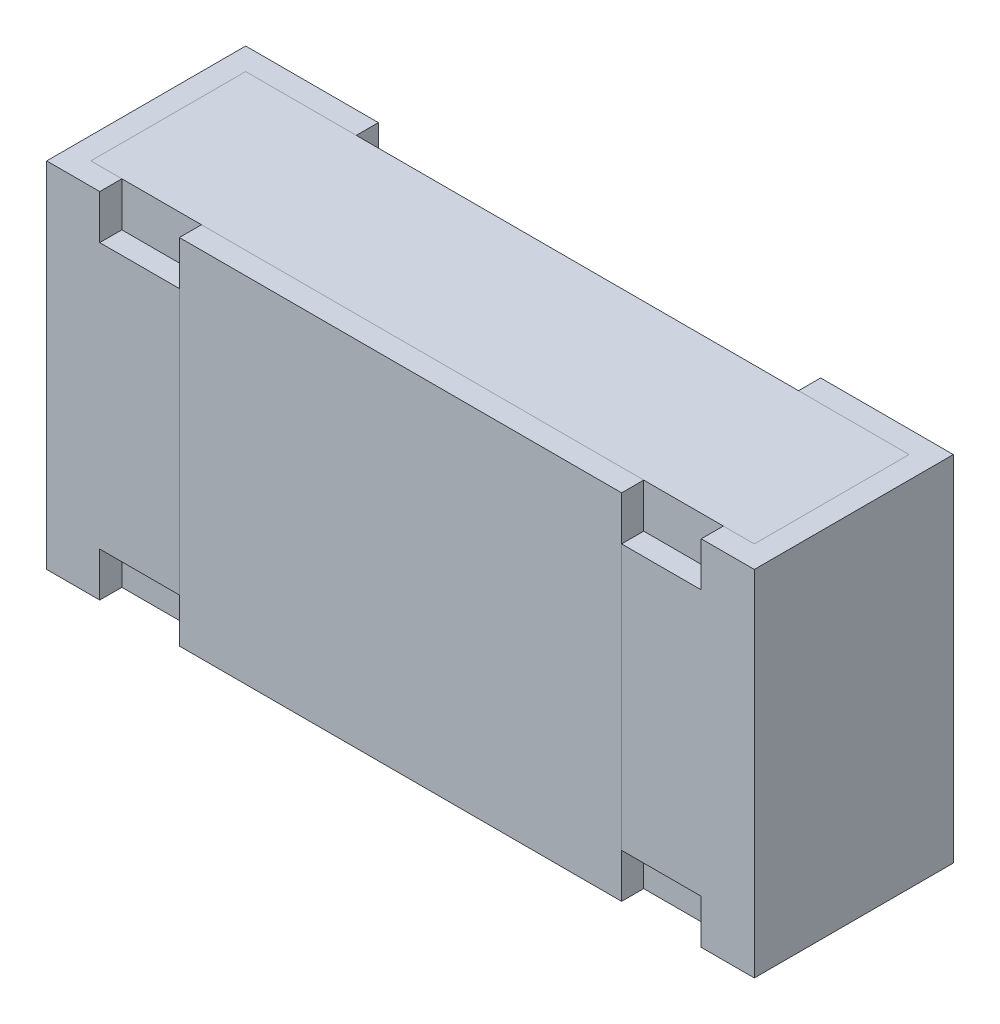
ISO-10303-21;
HEADER;
FILE_DESCRIPTION(('STEP AP214'),'2;1');
FILE_NAME('part.step','',(''),(''),'','','');
FILE_SCHEMA(('AUTOMOTIVE_DESIGN { 1 0 10303 214 1 1 1 1 }'));
ENDSEC;
DATA;
#1=APPLICATION_CONTEXT('core data for automotive mechanical design processes');
#2=APPLICATION_PROTOCOL_DEFINITION('international standard','automotive_design',2000,#1);
#3=PRODUCT_CONTEXT('',#1,'mechanical');
#4=PRODUCT('Part','Part','',(#3));
#5=PRODUCT_RELATED_PRODUCT_CATEGORY('part','',(#4));
#6=PRODUCT_DEFINITION_FORMATION('','',#4);
#7=PRODUCT_DEFINITION_CONTEXT('part definition',#1,'design');
#8=PRODUCT_DEFINITION('design','',#6,#7);
#9=PRODUCT_DEFINITION_SHAPE('','',#8);
#10=(LENGTH_UNIT() NAMED_UNIT(*) SI_UNIT(.MILLI.,.METRE.));
#11=(NAMED_UNIT(*) PLANE_ANGLE_UNIT() SI_UNIT($,.RADIAN.));
#12=(NAMED_UNIT(*) SI_UNIT($,.STERADIAN.) SOLID_ANGLE_UNIT());
#13=UNCERTAINTY_MEASURE_WITH_UNIT(LENGTH_MEASURE(1.E-05),#10,'distance_accuracy_value','');
#14=(GEOMETRIC_REPRESENTATION_CONTEXT(3) GLOBAL_UNCERTAINTY_ASSIGNED_CONTEXT((#13)) GLOBAL_UNIT_ASSIGNED_CONTEXT((#10,
#11,#12)) REPRESENTATION_CONTEXT('',''));
#15=CARTESIAN_POINT('',(0.,0.,0.));
#16=DIRECTION('',(0.,0.,1.));
#17=DIRECTION('',(1.,0.,0.));
#18=AXIS2_PLACEMENT_3D('',#15,#16,#17);
#19=CARTESIAN_POINT('',(-0.74991872,0.40008128,0.4));
#20=DIRECTION('',(1.,0.,0.));
#21=DIRECTION('',(0.,1.,0.));
#22=AXIS2_PLACEMENT_3D('',#19,#20,#21);
#23=PLANE('',#22);
#24=DIRECTION('',(0.,0.,-1.));
#25=VECTOR('',#24,1.);
#26=CARTESIAN_POINT('',(-0.74991872,0.40008128,0.4));
#27=LINE('',#26,#25);
#28=CARTESIAN_POINT('',(-0.74991872,0.40008128,0.4));
#29=VERTEX_POINT('',#28);
#30=CARTESIAN_POINT('',(-0.74991872,0.40008128,0.05));
#31=VERTEX_POINT('',#30);
#32=EDGE_CURVE('P0_E10',#29,#31,#27,.T.);
#33=ORIENTED_EDGE('',*,*,#32,.T.);
#34=DIRECTION('',(0.,-1.,0.));
#35=VECTOR('',#34,1.);
#36=CARTESIAN_POINT('',(-0.74991872,0.40008128,0.05));
#37=LINE('',#36,#35);
#38=CARTESIAN_POINT('',(-0.74991872,-0.39991872,0.05));
#39=VERTEX_POINT('',#38);
#40=EDGE_CURVE('P0_E23',#31,#39,#37,.T.);
#41=ORIENTED_EDGE('',*,*,#40,.T.);
#42=DIRECTION('',(0.,0.,-1.));
#43=VECTOR('',#42,1.);
#44=CARTESIAN_POINT('',(-0.74991872,-0.39991872,0.4));
#45=LINE('',#44,#43);
#46=CARTESIAN_POINT('',(-0.74991872,-0.39991872,0.4));
#47=VERTEX_POINT('',#46);
#48=EDGE_CURVE('P0_E85',#47,#39,#45,.T.);
#49=ORIENTED_EDGE('',*,*,#48,.F.);
#50=DIRECTION('',(0.,-1.,0.));
#51=VECTOR('',#50,1.);
#52=CARTESIAN_POINT('',(-0.74991872,0.40008128,0.4));
#53=LINE('',#52,#51);
#54=EDGE_CURVE('P0_E83',#29,#47,#53,.T.);
#55=ORIENTED_EDGE('',*,*,#54,.F.);
#56=EDGE_LOOP('',(#33,#41,#49,#55));
#57=FACE_BOUND('',#56,.T.);
#58=ADVANCED_FACE('P0_F16',(#57),#23,.F.);
#59=CARTESIAN_POINT('',(0.75008128,-0.39991872,0.4));
#60=DIRECTION('',(0.,1.,0.));
#61=DIRECTION('',(-1.,0.,0.));
#62=AXIS2_PLACEMENT_3D('',#59,#60,#61);
#63=PLANE('',#62);
#64=ORIENTED_EDGE('',*,*,#48,.T.);
#65=DIRECTION('',(-1.,0.,0.));
#66=VECTOR('',#65,1.);
#67=CARTESIAN_POINT('',(-0.74991872,-0.39991872,0.05));
#68=LINE('',#67,#66);
#69=CARTESIAN_POINT('',(0.75008128,-0.39991872,0.05));
#70=VERTEX_POINT('',#69);
#71=EDGE_CURVE('P0_E80',#70,#39,#68,.T.);
#72=ORIENTED_EDGE('',*,*,#71,.F.);
#73=DIRECTION('',(0.,0.,-1.));
#74=VECTOR('',#73,1.);
#75=CARTESIAN_POINT('',(0.75008128,-0.39991872,0.4));
#76=LINE('',#75,#74);
#77=CARTESIAN_POINT('',(0.75008128,-0.39991872,0.4));
#78=VERTEX_POINT('',#77);
#79=EDGE_CURVE('P0_E78',#78,#70,#76,.T.);
#80=ORIENTED_EDGE('',*,*,#79,.F.);
#81=DIRECTION('',(1.,0.,0.));
#82=VECTOR('',#81,1.);
#83=CARTESIAN_POINT('',(0.75008128,-0.39991872,0.4));
#84=LINE('',#83,#82);
#85=EDGE_CURVE('P0_E69',#47,#78,#84,.T.);
#86=ORIENTED_EDGE('',*,*,#85,.F.);
#87=EDGE_LOOP('',(#64,#72,#80,#86));
#88=FACE_BOUND('',#87,.T.);
#89=ADVANCED_FACE('P0_F89',(#88),#63,.F.);
#90=CARTESIAN_POINT('',(0.75008128,0.40008128,0.4));
#91=DIRECTION('',(-1.,0.,0.));
#92=DIRECTION('',(0.,-1.,0.));
#93=AXIS2_PLACEMENT_3D('',#90,#91,#92);
#94=PLANE('',#93);
#95=ORIENTED_EDGE('',*,*,#79,.T.);
#96=DIRECTION('',(0.,-1.,0.));
#97=VECTOR('',#96,1.);
#98=CARTESIAN_POINT('',(0.75008128,0.40008128,0.05));
#99=LINE('',#98,#97);
#100=CARTESIAN_POINT('',(0.75008128,0.40008128,0.05));
#101=VERTEX_POINT('',#100);
#102=EDGE_CURVE('P0_E59',#101,#70,#99,.T.);
#103=ORIENTED_EDGE('',*,*,#102,.F.);
#104=DIRECTION('',(0.,0.,-1.));
#105=VECTOR('',#104,1.);
#106=CARTESIAN_POINT('',(0.75008128,0.40008128,0.4));
#107=LINE('',#106,#105);
#108=CARTESIAN_POINT('',(0.75008128,0.40008128,0.4));
#109=VERTEX_POINT('',#108);
#110=EDGE_CURVE('P0_E53',#109,#101,#107,.T.);
#111=ORIENTED_EDGE('',*,*,#110,.F.);
#112=DIRECTION('',(0.,1.,0.));
#113=VECTOR('',#112,1.);
#114=CARTESIAN_POINT('',(0.75008128,0.40008128,0.4));
#115=LINE('',#114,#113);
#116=EDGE_CURVE('P0_E57',#78,#109,#115,.T.);
#117=ORIENTED_EDGE('',*,*,#116,.F.);
#118=EDGE_LOOP('',(#95,#103,#111,#117));
#119=FACE_BOUND('',#118,.T.);
#120=ADVANCED_FACE('P0_F56',(#119),#94,.F.);
#121=CARTESIAN_POINT('',(0.75008128,0.40008128,0.4));
#122=DIRECTION('',(0.,-1.,0.));
#123=DIRECTION('',(1.,0.,0.));
#124=AXIS2_PLACEMENT_3D('',#121,#122,#123);
#125=PLANE('',#124);
#126=ORIENTED_EDGE('',*,*,#110,.T.);
#127=DIRECTION('',(-1.,0.,0.));
#128=VECTOR('',#127,1.);
#129=CARTESIAN_POINT('',(-0.74991872,0.40008128,0.05));
#130=LINE('',#129,#128);
#131=EDGE_CURVE('P0_E70',#101,#31,#130,.T.);
#132=ORIENTED_EDGE('',*,*,#131,.T.);
#133=ORIENTED_EDGE('',*,*,#32,.F.);
#134=DIRECTION('',(-1.,0.,0.));
#135=VECTOR('',#134,1.);
#136=CARTESIAN_POINT('',(0.75008128,0.40008128,0.4));
#137=LINE('',#136,#135);
#138=EDGE_CURVE('P0_E67',#109,#29,#137,.T.);
#139=ORIENTED_EDGE('',*,*,#138,.F.);
#140=EDGE_LOOP('',(#126,#132,#133,#139));
#141=FACE_BOUND('',#140,.T.);
#142=ADVANCED_FACE('P0_F72',(#141),#125,.F.);
#143=CARTESIAN_POINT('',(-0.74991872,-0.39991872,0.4));
#144=DIRECTION('',(0.,0.,-1.));
#145=DIRECTION('',(0.,1.,0.));
#146=AXIS2_PLACEMENT_3D('',#143,#144,#145);
#147=PLANE('',#146);
#148=ORIENTED_EDGE('',*,*,#85,.T.);
#149=ORIENTED_EDGE('',*,*,#116,.T.);
#150=ORIENTED_EDGE('',*,*,#138,.T.);
#151=ORIENTED_EDGE('',*,*,#54,.T.);
#152=EDGE_LOOP('',(#148,#149,#150,#151));
#153=FACE_BOUND('',#152,.T.);
#154=ADVANCED_FACE('P0_F65',(#153),#147,.F.);
#155=CARTESIAN_POINT('',(-0.74991872,0.40008128,0.05));
#156=DIRECTION('',(0.,0.,1.));
#157=DIRECTION('',(0.,-1.,0.));
#158=AXIS2_PLACEMENT_3D('',#155,#156,#157);
#159=PLANE('',#158);
#160=ORIENTED_EDGE('',*,*,#71,.T.);
#161=ORIENTED_EDGE('',*,*,#40,.F.);
#162=ORIENTED_EDGE('',*,*,#131,.F.);
#163=ORIENTED_EDGE('',*,*,#102,.T.);
#164=EDGE_LOOP('',(#160,#161,#162,#163));
#165=FACE_BOUND('',#164,.T.);
#166=ADVANCED_FACE('P0_F90',(#165),#159,.F.);
#167=CLOSED_SHELL('',(#58,#89,#120,#142,#154,#166));
#168=MANIFOLD_SOLID_BREP('P0_B1',#167);
#169=CARTESIAN_POINT('',(1.30164225709407,-0.399918720000001,0.450000000000004));
#170=DIRECTION('',(0.,1.,0.));
#171=DIRECTION('',(-1.,0.,0.));
#172=AXIS2_PLACEMENT_3D('',#169,#170,#171);
#173=PLANE('',#172);
#174=DIRECTION('',(0.,0.,-1.));
#175=VECTOR('',#174,1.);
#176=CARTESIAN_POINT('',(0.50008128,-0.39991872,0.450000000000006));
#177=LINE('',#176,#175);
#178=CARTESIAN_POINT('',(0.50008128,-0.39991872,0.450000000000002));
#179=VERTEX_POINT('',#178);
#180=CARTESIAN_POINT('',(0.50008128,-0.39991872,0.400000000000002));
#181=VERTEX_POINT('',#180);
#182=EDGE_CURVE('P1_E11',#179,#181,#177,.T.);
#183=ORIENTED_EDGE('',*,*,#182,.F.);
#184=DIRECTION('',(-1.,0.,0.));
#185=VECTOR('',#184,1.);
#186=CARTESIAN_POINT('',(1.30164225709407,-0.399918720000001,0.450000000000004));
#187=LINE('',#186,#185);
#188=CARTESIAN_POINT('',(-0.49991872,-0.39991872,0.45));
#189=VERTEX_POINT('',#188);
#190=EDGE_CURVE('P1_E24',#179,#189,#187,.T.);
#191=ORIENTED_EDGE('',*,*,#190,.T.);
#192=DIRECTION('',(0.,0.,-1.));
#193=VECTOR('',#192,1.);
#194=CARTESIAN_POINT('',(-0.49991872,-0.39991872,0.45));
#195=LINE('',#194,#193);
#196=CARTESIAN_POINT('',(-0.49991872,-0.39991872,0.4));
#197=VERTEX_POINT('',#196);
#198=EDGE_CURVE('P1_E75',#189,#197,#195,.T.);
#199=ORIENTED_EDGE('',*,*,#198,.T.);
#200=DIRECTION('',(-1.,0.,0.));
#201=VECTOR('',#200,1.);
#202=CARTESIAN_POINT('',(1.30164225709407,-0.399918720000001,0.400000000000004));
#203=LINE('',#202,#201);
#204=EDGE_CURVE('P1_E85',#181,#197,#203,.T.);
#205=ORIENTED_EDGE('',*,*,#204,.F.);
#206=EDGE_LOOP('',(#183,#191,#199,#205));
#207=FACE_BOUND('',#206,.T.);
#208=ADVANCED_FACE('P1_F17',(#207),#173,.F.);
#209=CARTESIAN_POINT('',(1.30164225709407,-0.399918720000001,0.400000000000004));
#210=DIRECTION('',(0.,0.,1.));
#211=DIRECTION('',(-1.,0.,0.));
#212=AXIS2_PLACEMENT_3D('',#209,#210,#211);
#213=PLANE('',#212);
#214=DIRECTION('',(0.,1.,0.));
#215=VECTOR('',#214,1.);
#216=CARTESIAN_POINT('',(0.50008128,-0.399918720000001,0.400000000000002));
#217=LINE('',#216,#215);
#218=CARTESIAN_POINT('',(0.50008128,0.40008128,0.400000000000002));
#219=VERTEX_POINT('',#218);
#220=EDGE_CURVE('P1_E83',#181,#219,#217,.T.);
#221=ORIENTED_EDGE('',*,*,#220,.F.);
#222=ORIENTED_EDGE('',*,*,#204,.T.);
#223=DIRECTION('',(0.,1.,0.));
#224=VECTOR('',#223,1.);
#225=CARTESIAN_POINT('',(-0.49991872,-0.39991872,0.4));
#226=LINE('',#225,#224);
#227=CARTESIAN_POINT('',(-0.49991872,0.40008128,0.4));
#228=VERTEX_POINT('',#227);
#229=EDGE_CURVE('P1_E81',#197,#228,#226,.T.);
#230=ORIENTED_EDGE('',*,*,#229,.T.);
#231=DIRECTION('',(-1.,0.,0.));
#232=VECTOR('',#231,1.);
#233=CARTESIAN_POINT('',(1.30164225709407,0.40008128,0.400000000000004));
#234=LINE('',#233,#232);
#235=EDGE_CURVE('P1_E61',#219,#228,#234,.T.);
#236=ORIENTED_EDGE('',*,*,#235,.F.);
#237=EDGE_LOOP('',(#221,#222,#230,#236));
#238=FACE_BOUND('',#237,.T.);
#239=ADVANCED_FACE('P1_F91',(#238),#213,.F.);
#240=CARTESIAN_POINT('',(1.30164225709407,0.40008128,0.450000000000004));
#241=DIRECTION('',(0.,-1.,0.));
#242=DIRECTION('',(1.,0.,0.));
#243=AXIS2_PLACEMENT_3D('',#240,#241,#242);
#244=PLANE('',#243);
#245=DIRECTION('',(0.,0.,1.));
#246=VECTOR('',#245,1.);
#247=CARTESIAN_POINT('',(0.50008128,0.40008128,0.450000000000006));
#248=LINE('',#247,#246);
#249=CARTESIAN_POINT('',(0.50008128,0.40008128,0.450000000000002));
#250=VERTEX_POINT('',#249);
#251=EDGE_CURVE('P1_E65',#219,#250,#248,.T.);
#252=ORIENTED_EDGE('',*,*,#251,.F.);
#253=ORIENTED_EDGE('',*,*,#235,.T.);
#254=DIRECTION('',(0.,0.,1.));
#255=VECTOR('',#254,1.);
#256=CARTESIAN_POINT('',(-0.49991872,0.40008128,0.45));
#257=LINE('',#256,#255);
#258=CARTESIAN_POINT('',(-0.49991872,0.40008128,0.45));
#259=VERTEX_POINT('',#258);
#260=EDGE_CURVE('P1_E54',#228,#259,#257,.T.);
#261=ORIENTED_EDGE('',*,*,#260,.T.);
#262=DIRECTION('',(-1.,0.,0.));
#263=VECTOR('',#262,1.);
#264=CARTESIAN_POINT('',(1.30164225709407,0.40008128,0.450000000000004));
#265=LINE('',#264,#263);
#266=EDGE_CURVE('P1_E58',#250,#259,#265,.T.);
#267=ORIENTED_EDGE('',*,*,#266,.F.);
#268=EDGE_LOOP('',(#252,#253,#261,#267));
#269=FACE_BOUND('',#268,.T.);
#270=ADVANCED_FACE('P1_F57',(#269),#244,.F.);
#271=CARTESIAN_POINT('',(1.30164225709407,-0.399918720000001,0.450000000000004));
#272=DIRECTION('',(0.,0.,-1.));
#273=DIRECTION('',(1.,0.,0.));
#274=AXIS2_PLACEMENT_3D('',#271,#272,#273);
#275=PLANE('',#274);
#276=DIRECTION('',(0.,-1.,0.));
#277=VECTOR('',#276,1.);
#278=CARTESIAN_POINT('',(0.50008128,-0.399918720000001,0.450000000000002));
#279=LINE('',#278,#277);
#280=EDGE_CURVE('P1_E71',#250,#179,#279,.T.);
#281=ORIENTED_EDGE('',*,*,#280,.F.);
#282=ORIENTED_EDGE('',*,*,#266,.T.);
#283=DIRECTION('',(0.,-1.,0.));
#284=VECTOR('',#283,1.);
#285=CARTESIAN_POINT('',(-0.49991872,-0.39991872,0.45));
#286=LINE('',#285,#284);
#287=EDGE_CURVE('P1_E70',#259,#189,#286,.T.);
#288=ORIENTED_EDGE('',*,*,#287,.T.);
#289=ORIENTED_EDGE('',*,*,#190,.F.);
#290=EDGE_LOOP('',(#281,#282,#288,#289));
#291=FACE_BOUND('',#290,.T.);
#292=ADVANCED_FACE('P1_F69',(#291),#275,.F.);
#293=CARTESIAN_POINT('',(-0.49991872,-0.39991872,0.4));
#294=DIRECTION('',(1.,0.,0.));
#295=DIRECTION('',(0.,0.,1.));
#296=AXIS2_PLACEMENT_3D('',#293,#294,#295);
#297=PLANE('',#296);
#298=ORIENTED_EDGE('',*,*,#260,.F.);
#299=ORIENTED_EDGE('',*,*,#229,.F.);
#300=ORIENTED_EDGE('',*,*,#198,.F.);
#301=ORIENTED_EDGE('',*,*,#287,.F.);
#302=EDGE_LOOP('',(#298,#299,#300,#301));
#303=FACE_BOUND('',#302,.T.);
#304=ADVANCED_FACE('P1_F74',(#303),#297,.F.);
#305=CARTESIAN_POINT('',(0.50008128,-0.39991872,0.45));
#306=DIRECTION('',(1.,0.,0.));
#307=DIRECTION('',(0.,0.,-1.));
#308=AXIS2_PLACEMENT_3D('',#305,#306,#307);
#309=PLANE('',#308);
#310=ORIENTED_EDGE('',*,*,#280,.T.);
#311=ORIENTED_EDGE('',*,*,#182,.T.);
#312=ORIENTED_EDGE('',*,*,#220,.T.);
#313=ORIENTED_EDGE('',*,*,#251,.T.);
#314=EDGE_LOOP('',(#310,#311,#312,#313));
#315=FACE_BOUND('',#314,.T.);
#316=ADVANCED_FACE('P1_F88',(#315),#309,.T.);
#317=CLOSED_SHELL('',(#208,#239,#270,#292,#304,#316));
#318=MANIFOLD_SOLID_BREP('P1_B1',#317);
#319=CARTESIAN_POINT('',(-0.74991872,0.40008128,0.0499999999999998));
#320=DIRECTION('',(0.,0.,-1.));
#321=DIRECTION('',(0.,1.,0.));
#322=AXIS2_PLACEMENT_3D('',#319,#320,#321);
#323=PLANE('',#322);
#324=DIRECTION('',(0.,-1.,0.));
#325=VECTOR('',#324,1.);
#326=CARTESIAN_POINT('',(-0.49991872,0.40008128,0.0499999999999999));
#327=LINE('',#326,#325);
#328=CARTESIAN_POINT('',(-0.49991872,0.40008128,0.0500000000000003));
#329=VERTEX_POINT('',#328);
#330=CARTESIAN_POINT('',(-0.49991872,-0.39991872,0.05));
#331=VERTEX_POINT('',#330);
#332=EDGE_CURVE('P2_E11',#329,#331,#327,.T.);
#333=ORIENTED_EDGE('',*,*,#332,.F.);
#334=DIRECTION('',(1.,0.,0.));
#335=VECTOR('',#334,1.);
#336=CARTESIAN_POINT('',(-0.74991872,0.40008128,0.0500000000000002));
#337=LINE('',#336,#335);
#338=CARTESIAN_POINT('',(-0.74991872,0.40008128,0.0500000000000002));
#339=VERTEX_POINT('',#338);
#340=EDGE_CURVE('P2_E24',#339,#329,#337,.T.);
#341=ORIENTED_EDGE('',*,*,#340,.F.);
#342=DIRECTION('',(0.,1.,0.));
#343=VECTOR('',#342,1.);
#344=CARTESIAN_POINT('',(-0.74991872,0.40008128,0.0499999999999998));
#345=LINE('',#344,#343);
#346=CARTESIAN_POINT('',(-0.74991872,-0.39991872,0.0500000000000003));
#347=VERTEX_POINT('',#346);
#348=EDGE_CURVE('P2_E203',#347,#339,#345,.T.);
#349=ORIENTED_EDGE('',*,*,#348,.F.);
#350=DIRECTION('',(1.,0.,0.));
#351=VECTOR('',#350,1.);
#352=CARTESIAN_POINT('',(-0.74991872,-0.39991872,0.0500000000000003));
#353=LINE('',#352,#351);
#354=EDGE_CURVE('P2_E201',#347,#331,#353,.T.);
#355=ORIENTED_EDGE('',*,*,#354,.T.);
#356=EDGE_LOOP('',(#333,#341,#349,#355));
#357=FACE_BOUND('',#356,.T.);
#358=ADVANCED_FACE('P2_F17',(#357),#323,.F.);
#359=CARTESIAN_POINT('',(-0.79991872,-0.39991872,0.));
#360=DIRECTION('',(0.,0.,1.));
#361=DIRECTION('',(-1.,0.,0.));
#362=AXIS2_PLACEMENT_3D('',#359,#360,#361);
#363=PLANE('',#362);
#364=DIRECTION('',(0.,1.,0.));
#365=VECTOR('',#364,1.);
#366=CARTESIAN_POINT('',(-0.49991872,-0.39991872,0.));
#367=LINE('',#366,#365);
#368=CARTESIAN_POINT('',(-0.49991872,-0.39991872,0.));
#369=VERTEX_POINT('',#368);
#370=CARTESIAN_POINT('',(-0.49991872,0.40008128,0.));
#371=VERTEX_POINT('',#370);
#372=EDGE_CURVE('P2_E199',#369,#371,#367,.T.);
#373=ORIENTED_EDGE('',*,*,#372,.F.);
#374=DIRECTION('',(1.,0.,0.));
#375=VECTOR('',#374,1.);
#376=CARTESIAN_POINT('',(-0.79991872,-0.39991872,0.));
#377=LINE('',#376,#375);
#378=CARTESIAN_POINT('',(-0.79991872,-0.39991872,0.));
#379=VERTEX_POINT('',#378);
#380=EDGE_CURVE('P2_E196',#379,#369,#377,.T.);
#381=ORIENTED_EDGE('',*,*,#380,.F.);
#382=DIRECTION('',(0.,-1.,0.));
#383=VECTOR('',#382,1.);
#384=CARTESIAN_POINT('',(-0.79991872,-0.39991872,0.));
#385=LINE('',#384,#383);
#386=CARTESIAN_POINT('',(-0.79991872,0.40008128,0.));
#387=VERTEX_POINT('',#386);
#388=EDGE_CURVE('P2_E193',#387,#379,#385,.T.);
#389=ORIENTED_EDGE('',*,*,#388,.F.);
#390=DIRECTION('',(1.,0.,0.));
#391=VECTOR('',#390,1.);
#392=CARTESIAN_POINT('',(-0.79991872,0.40008128,0.));
#393=LINE('',#392,#391);
#394=EDGE_CURVE('P2_E190',#387,#371,#393,.T.);
#395=ORIENTED_EDGE('',*,*,#394,.T.);
#396=EDGE_LOOP('',(#373,#381,#389,#395));
#397=FACE_BOUND('',#396,.T.);
#398=ADVANCED_FACE('P2_F213',(#397),#363,.F.);
#399=CARTESIAN_POINT('',(-0.74991872,0.400081280000001,0.4));
#400=DIRECTION('',(1.,0.,0.));
#401=DIRECTION('',(0.,0.,1.));
#402=AXIS2_PLACEMENT_3D('',#399,#400,#401);
#403=PLANE('',#402);
#404=DIRECTION('',(0.,0.,-1.));
#405=VECTOR('',#404,1.);
#406=CARTESIAN_POINT('',(-0.74991872,-0.39991872,0.4));
#407=LINE('',#406,#405);
#408=CARTESIAN_POINT('',(-0.74991872,-0.39991872,0.4));
#409=VERTEX_POINT('',#408);
#410=EDGE_CURVE('P2_E187',#409,#347,#407,.T.);
#411=ORIENTED_EDGE('',*,*,#410,.T.);
#412=ORIENTED_EDGE('',*,*,#348,.T.);
#413=DIRECTION('',(0.,0.,-1.));
#414=VECTOR('',#413,1.);
#415=CARTESIAN_POINT('',(-0.74991872,0.40008128,0.4));
#416=LINE('',#415,#414);
#417=CARTESIAN_POINT('',(-0.74991872,0.40008128,0.4));
#418=VERTEX_POINT('',#417);
#419=EDGE_CURVE('P2_E184',#418,#339,#416,.T.);
#420=ORIENTED_EDGE('',*,*,#419,.F.);
#421=DIRECTION('',(0.,-1.,0.));
#422=VECTOR('',#421,1.);
#423=CARTESIAN_POINT('',(-0.74991872,0.400081280000001,0.4));
#424=LINE('',#423,#422);
#425=EDGE_CURVE('P2_E181',#418,#409,#424,.T.);
#426=ORIENTED_EDGE('',*,*,#425,.T.);
#427=EDGE_LOOP('',(#411,#412,#420,#426));
#428=FACE_BOUND('',#427,.T.);
#429=ADVANCED_FACE('P2_F223',(#428),#403,.T.);
#430=CARTESIAN_POINT('',(-0.79991872,-0.39991872,0.45));
#431=DIRECTION('',(-1.,0.,0.));
#432=DIRECTION('',(0.,0.,-1.));
#433=AXIS2_PLACEMENT_3D('',#430,#431,#432);
#434=PLANE('',#433);
#435=DIRECTION('',(0.,0.,-1.));
#436=VECTOR('',#435,1.);
#437=CARTESIAN_POINT('',(-0.79991872,0.40008128,0.45));
#438=LINE('',#437,#436);
#439=CARTESIAN_POINT('',(-0.79991872,0.40008128,0.45));
#440=VERTEX_POINT('',#439);
#441=EDGE_CURVE('P2_E178',#440,#387,#438,.T.);
#442=ORIENTED_EDGE('',*,*,#441,.T.);
#443=ORIENTED_EDGE('',*,*,#388,.T.);
#444=DIRECTION('',(0.,0.,-1.));
#445=VECTOR('',#444,1.);
#446=CARTESIAN_POINT('',(-0.79991872,-0.39991872,0.45));
#447=LINE('',#446,#445);
#448=CARTESIAN_POINT('',(-0.79991872,-0.39991872,0.45));
#449=VERTEX_POINT('',#448);
#450=EDGE_CURVE('P2_E175',#449,#379,#447,.T.);
#451=ORIENTED_EDGE('',*,*,#450,.F.);
#452=DIRECTION('',(0.,1.,0.));
#453=VECTOR('',#452,1.);
#454=CARTESIAN_POINT('',(-0.79991872,-0.39991872,0.45));
#455=LINE('',#454,#453);
#456=EDGE_CURVE('P2_E172',#449,#440,#455,.T.);
#457=ORIENTED_EDGE('',*,*,#456,.T.);
#458=EDGE_LOOP('',(#442,#443,#451,#457));
#459=FACE_BOUND('',#458,.T.);
#460=ADVANCED_FACE('P2_F215',(#459),#434,.T.);
#461=CARTESIAN_POINT('',(-1.57647969709407,0.400081280000001,0.4));
#462=DIRECTION('',(0.,0.,1.));
#463=DIRECTION('',(0.,-1.,0.));
#464=AXIS2_PLACEMENT_3D('',#461,#462,#463);
#465=PLANE('',#464);
#466=DIRECTION('',(0.,-1.,0.));
#467=VECTOR('',#466,1.);
#468=CARTESIAN_POINT('',(-0.49991872,0.40008128,0.4));
#469=LINE('',#468,#467);
#470=CARTESIAN_POINT('',(-0.49991872,0.300081280000001,0.4));
#471=VERTEX_POINT('',#470);
#472=CARTESIAN_POINT('',(-0.49991872,-0.29991872,0.4));
#473=VERTEX_POINT('',#472);
#474=EDGE_CURVE('P2_E170',#471,#473,#469,.T.);
#475=ORIENTED_EDGE('',*,*,#474,.T.);
#476=DIRECTION('',(1.,0.,0.));
#477=VECTOR('',#476,1.);
#478=CARTESIAN_POINT('',(-0.49991872,-0.29991872,0.4));
#479=LINE('',#478,#477);
#480=CARTESIAN_POINT('',(-0.67991872,-0.29991872,0.4));
#481=VERTEX_POINT('',#480);
#482=EDGE_CURVE('P2_E167',#481,#473,#479,.T.);
#483=ORIENTED_EDGE('',*,*,#482,.F.);
#484=DIRECTION('',(0.,1.,0.));
#485=VECTOR('',#484,1.);
#486=CARTESIAN_POINT('',(-0.67991872,-0.39991872,0.4));
#487=LINE('',#486,#485);
#488=CARTESIAN_POINT('',(-0.67991872,-0.39991872,0.4));
#489=VERTEX_POINT('',#488);
#490=EDGE_CURVE('P2_E164',#489,#481,#487,.T.);
#491=ORIENTED_EDGE('',*,*,#490,.F.);
#492=DIRECTION('',(1.,0.,0.));
#493=VECTOR('',#492,1.);
#494=CARTESIAN_POINT('',(-1.57647969709407,-0.39991872,0.4));
#495=LINE('',#494,#493);
#496=EDGE_CURVE('P2_E161',#409,#489,#495,.T.);
#497=ORIENTED_EDGE('',*,*,#496,.F.);
#498=ORIENTED_EDGE('',*,*,#425,.F.);
#499=DIRECTION('',(1.,0.,0.));
#500=VECTOR('',#499,1.);
#501=CARTESIAN_POINT('',(-1.57647969709407,0.400081280000001,0.4));
#502=LINE('',#501,#500);
#503=CARTESIAN_POINT('',(-0.67991872,0.40008128,0.4));
#504=VERTEX_POINT('',#503);
#505=EDGE_CURVE('P2_E159',#418,#504,#502,.T.);
#506=ORIENTED_EDGE('',*,*,#505,.T.);
#507=DIRECTION('',(0.,1.,0.));
#508=VECTOR('',#507,1.);
#509=CARTESIAN_POINT('',(-0.67991872,0.40008128,0.4));
#510=LINE('',#509,#508);
#511=CARTESIAN_POINT('',(-0.67991872,0.300081280000001,0.4));
#512=VERTEX_POINT('',#511);
#513=EDGE_CURVE('P2_E157',#512,#504,#510,.T.);
#514=ORIENTED_EDGE('',*,*,#513,.F.);
#515=DIRECTION('',(-1.,0.,0.));
#516=VECTOR('',#515,1.);
#517=CARTESIAN_POINT('',(-0.49991872,0.300081280000001,0.4));
#518=LINE('',#517,#516);
#519=EDGE_CURVE('P2_E127',#471,#512,#518,.T.);
#520=ORIENTED_EDGE('',*,*,#519,.F.);
#521=EDGE_LOOP('',(#475,#483,#491,#497,#498,#506,#514,#520));
#522=FACE_BOUND('',#521,.T.);
#523=ADVANCED_FACE('P2_F219',(#522),#465,.F.);
#524=CARTESIAN_POINT('',(-1.57647969709407,0.400081280000001,0.45));
#525=DIRECTION('',(0.,-1.,0.));
#526=DIRECTION('',(1.,0.,0.));
#527=AXIS2_PLACEMENT_3D('',#524,#525,#526);
#528=PLANE('',#527);
#529=DIRECTION('',(1.,0.,0.));
#530=VECTOR('',#529,1.);
#531=CARTESIAN_POINT('',(-1.57647969709407,0.400081280000001,0.45));
#532=LINE('',#531,#530);
#533=CARTESIAN_POINT('',(-0.67991872,0.400081280000001,0.45));
#534=VERTEX_POINT('',#533);
#535=EDGE_CURVE('P2_E154',#440,#534,#532,.T.);
#536=ORIENTED_EDGE('',*,*,#535,.T.);
#537=DIRECTION('',(0.,0.,1.));
#538=VECTOR('',#537,1.);
#539=CARTESIAN_POINT('',(-0.67991872,0.400081280000001,-0.00100000000000021));
#540=LINE('',#539,#538);
#541=EDGE_CURVE('P2_E122',#504,#534,#540,.T.);
#542=ORIENTED_EDGE('',*,*,#541,.F.);
#543=ORIENTED_EDGE('',*,*,#505,.F.);
#544=ORIENTED_EDGE('',*,*,#419,.T.);
#545=ORIENTED_EDGE('',*,*,#340,.T.);
#546=DIRECTION('',(0.,0.,1.));
#547=VECTOR('',#546,1.);
#548=CARTESIAN_POINT('',(-0.49991872,0.40008128,0.225));
#549=LINE('',#548,#547);
#550=EDGE_CURVE('P2_E151',#371,#329,#549,.T.);
#551=ORIENTED_EDGE('',*,*,#550,.F.);
#552=ORIENTED_EDGE('',*,*,#394,.F.);
#553=ORIENTED_EDGE('',*,*,#441,.F.);
#554=EDGE_LOOP('',(#536,#542,#543,#544,#545,#551,#552,#553));
#555=FACE_BOUND('',#554,.T.);
#556=ADVANCED_FACE('P2_F207',(#555),#528,.F.);
#557=CARTESIAN_POINT('',(-1.57647969709407,-0.39991872,0.45));
#558=DIRECTION('',(0.,0.,-1.));
#559=DIRECTION('',(0.,1.,0.));
#560=AXIS2_PLACEMENT_3D('',#557,#558,#559);
#561=PLANE('',#560);
#562=DIRECTION('',(0.,-1.,0.));
#563=VECTOR('',#562,1.);
#564=CARTESIAN_POINT('',(-0.67991872,-0.39991872,0.45));
#565=LINE('',#564,#563);
#566=CARTESIAN_POINT('',(-0.67991872,-0.29991872,0.45));
#567=VERTEX_POINT('',#566);
#568=CARTESIAN_POINT('',(-0.67991872,-0.39991872,0.45));
#569=VERTEX_POINT('',#568);
#570=EDGE_CURVE('P2_E148',#567,#569,#565,.T.);
#571=ORIENTED_EDGE('',*,*,#570,.F.);
#572=DIRECTION('',(-1.,0.,0.));
#573=VECTOR('',#572,1.);
#574=CARTESIAN_POINT('',(-0.49991872,-0.29991872,0.45));
#575=LINE('',#574,#573);
#576=CARTESIAN_POINT('',(-0.49991872,-0.29991872,0.45));
#577=VERTEX_POINT('',#576);
#578=EDGE_CURVE('P2_E145',#577,#567,#575,.T.);
#579=ORIENTED_EDGE('',*,*,#578,.F.);
#580=DIRECTION('',(0.,1.,0.));
#581=VECTOR('',#580,1.);
#582=CARTESIAN_POINT('',(-0.49991872,-0.39991872,0.45));
#583=LINE('',#582,#581);
#584=CARTESIAN_POINT('',(-0.49991872,0.300081280000001,0.45));
#585=VERTEX_POINT('',#584);
#586=EDGE_CURVE('P2_E109',#577,#585,#583,.T.);
#587=ORIENTED_EDGE('',*,*,#586,.T.);
#588=DIRECTION('',(1.,0.,0.));
#589=VECTOR('',#588,1.);
#590=CARTESIAN_POINT('',(-0.49991872,0.300081280000001,0.45));
#591=LINE('',#590,#589);
#592=CARTESIAN_POINT('',(-0.67991872,0.300081280000001,0.45));
#593=VERTEX_POINT('',#592);
#594=EDGE_CURVE('P2_E102',#593,#585,#591,.T.);
#595=ORIENTED_EDGE('',*,*,#594,.F.);
#596=DIRECTION('',(0.,-1.,0.));
#597=VECTOR('',#596,1.);
#598=CARTESIAN_POINT('',(-0.67991872,0.400081280000001,0.45));
#599=LINE('',#598,#597);
#600=EDGE_CURVE('P2_E106',#534,#593,#599,.T.);
#601=ORIENTED_EDGE('',*,*,#600,.F.);
#602=ORIENTED_EDGE('',*,*,#535,.F.);
#603=ORIENTED_EDGE('',*,*,#456,.F.);
#604=DIRECTION('',(1.,0.,0.));
#605=VECTOR('',#604,1.);
#606=CARTESIAN_POINT('',(-1.57647969709407,-0.39991872,0.45));
#607=LINE('',#606,#605);
#608=EDGE_CURVE('P2_E123',#449,#569,#607,.T.);
#609=ORIENTED_EDGE('',*,*,#608,.T.);
#610=EDGE_LOOP('',(#571,#579,#587,#595,#601,#602,#603,#609));
#611=FACE_BOUND('',#610,.T.);
#612=ADVANCED_FACE('P2_F104',(#611),#561,.F.);
#613=CARTESIAN_POINT('',(-1.57647969709407,-0.39991872,0.4));
#614=DIRECTION('',(0.,1.,0.));
#615=DIRECTION('',(0.,0.,1.));
#616=AXIS2_PLACEMENT_3D('',#613,#614,#615);
#617=PLANE('',#616);
#618=ORIENTED_EDGE('',*,*,#496,.T.);
#619=DIRECTION('',(0.,0.,1.));
#620=VECTOR('',#619,1.);
#621=CARTESIAN_POINT('',(-0.67991872,-0.39991872,-0.00100000000000016));
#622=LINE('',#621,#620);
#623=EDGE_CURVE('P2_E140',#489,#569,#622,.T.);
#624=ORIENTED_EDGE('',*,*,#623,.T.);
#625=ORIENTED_EDGE('',*,*,#608,.F.);
#626=ORIENTED_EDGE('',*,*,#450,.T.);
#627=ORIENTED_EDGE('',*,*,#380,.T.);
#628=DIRECTION('',(0.,0.,-1.));
#629=VECTOR('',#628,1.);
#630=CARTESIAN_POINT('',(-0.49991872,-0.39991872,0.225));
#631=LINE('',#630,#629);
#632=EDGE_CURVE('P2_E138',#331,#369,#631,.T.);
#633=ORIENTED_EDGE('',*,*,#632,.F.);
#634=ORIENTED_EDGE('',*,*,#354,.F.);
#635=ORIENTED_EDGE('',*,*,#410,.F.);
#636=EDGE_LOOP('',(#618,#624,#625,#626,#627,#633,#634,#635));
#637=FACE_BOUND('',#636,.T.);
#638=ADVANCED_FACE('P2_F226',(#637),#617,.F.);
#639=CARTESIAN_POINT('',(-0.49991872,-0.39991872,0.45));
#640=DIRECTION('',(-1.,0.,0.));
#641=DIRECTION('',(0.,0.,-1.));
#642=AXIS2_PLACEMENT_3D('',#639,#640,#641);
#643=PLANE('',#642);
#644=ORIENTED_EDGE('',*,*,#586,.F.);
#645=DIRECTION('',(0.,0.,1.));
#646=VECTOR('',#645,1.);
#647=CARTESIAN_POINT('',(-0.49991872,-0.29991872,-0.00100000000000017));
#648=LINE('',#647,#646);
#649=EDGE_CURVE('P2_E131',#473,#577,#648,.T.);
#650=ORIENTED_EDGE('',*,*,#649,.F.);
#651=ORIENTED_EDGE('',*,*,#474,.F.);
#652=DIRECTION('',(0.,0.,1.));
#653=VECTOR('',#652,1.);
#654=CARTESIAN_POINT('',(-0.49991872,0.30008128,-0.0010000000000002));
#655=LINE('',#654,#653);
#656=EDGE_CURVE('P2_E128',#471,#585,#655,.T.);
#657=ORIENTED_EDGE('',*,*,#656,.T.);
#658=EDGE_LOOP('',(#644,#650,#651,#657));
#659=FACE_BOUND('',#658,.T.);
#660=ADVANCED_FACE('P2_F235',(#659),#643,.F.);
#661=CARTESIAN_POINT('',(-0.49991872,8.12800000002324E-05,0.0250000000000001));
#662=DIRECTION('',(1.,0.,0.));
#663=DIRECTION('',(0.,0.,1.));
#664=AXIS2_PLACEMENT_3D('',#661,#662,#663);
#665=PLANE('',#664);
#666=ORIENTED_EDGE('',*,*,#632,.T.);
#667=ORIENTED_EDGE('',*,*,#372,.T.);
#668=ORIENTED_EDGE('',*,*,#550,.T.);
#669=ORIENTED_EDGE('',*,*,#332,.T.);
#670=EDGE_LOOP('',(#666,#667,#668,#669));
#671=FACE_BOUND('',#670,.T.);
#672=ADVANCED_FACE('P2_F210',(#671),#665,.T.);
#673=CARTESIAN_POINT('',(-0.67991872,0.400081280000001,-0.00100000000000021));
#674=DIRECTION('',(-1.,0.,0.));
#675=DIRECTION('',(0.,-1.,0.));
#676=AXIS2_PLACEMENT_3D('',#673,#674,#675);
#677=PLANE('',#676);
#678=ORIENTED_EDGE('',*,*,#513,.T.);
#679=ORIENTED_EDGE('',*,*,#541,.T.);
#680=ORIENTED_EDGE('',*,*,#600,.T.);
#681=DIRECTION('',(0.,0.,1.));
#682=VECTOR('',#681,1.);
#683=CARTESIAN_POINT('',(-0.67991872,0.300081280000001,-0.0010000000000002));
#684=LINE('',#683,#682);
#685=EDGE_CURVE('P2_E119',#512,#593,#684,.T.);
#686=ORIENTED_EDGE('',*,*,#685,.F.);
#687=EDGE_LOOP('',(#678,#679,#680,#686));
#688=FACE_BOUND('',#687,.T.);
#689=ADVANCED_FACE('P2_F118',(#688),#677,.F.);
#690=CARTESIAN_POINT('',(-0.49991872,0.30008128,-0.0010000000000002));
#691=DIRECTION('',(0.,-1.,0.));
#692=DIRECTION('',(1.,0.,0.));
#693=AXIS2_PLACEMENT_3D('',#690,#691,#692);
#694=PLANE('',#693);
#695=ORIENTED_EDGE('',*,*,#519,.T.);
#696=ORIENTED_EDGE('',*,*,#685,.T.);
#697=ORIENTED_EDGE('',*,*,#594,.T.);
#698=ORIENTED_EDGE('',*,*,#656,.F.);
#699=EDGE_LOOP('',(#695,#696,#697,#698));
#700=FACE_BOUND('',#699,.T.);
#701=ADVANCED_FACE('P2_F125',(#700),#694,.F.);
#702=CARTESIAN_POINT('',(-0.49991872,-0.29991872,-0.00100000000000017));
#703=DIRECTION('',(0.,1.,0.));
#704=DIRECTION('',(-1.,0.,0.));
#705=AXIS2_PLACEMENT_3D('',#702,#703,#704);
#706=PLANE('',#705);
#707=ORIENTED_EDGE('',*,*,#482,.T.);
#708=ORIENTED_EDGE('',*,*,#649,.T.);
#709=ORIENTED_EDGE('',*,*,#578,.T.);
#710=DIRECTION('',(0.,0.,1.));
#711=VECTOR('',#710,1.);
#712=CARTESIAN_POINT('',(-0.67991872,-0.29991872,-0.00100000000000017));
#713=LINE('',#712,#711);
#714=EDGE_CURVE('P2_E129',#481,#567,#713,.T.);
#715=ORIENTED_EDGE('',*,*,#714,.F.);
#716=EDGE_LOOP('',(#707,#708,#709,#715));
#717=FACE_BOUND('',#716,.T.);
#718=ADVANCED_FACE('P2_F232',(#717),#706,.F.);
#719=CARTESIAN_POINT('',(-0.67991872,-0.39991872,-0.00100000000000016));
#720=DIRECTION('',(-1.,0.,0.));
#721=DIRECTION('',(0.,-1.,0.));
#722=AXIS2_PLACEMENT_3D('',#719,#720,#721);
#723=PLANE('',#722);
#724=ORIENTED_EDGE('',*,*,#490,.T.);
#725=ORIENTED_EDGE('',*,*,#714,.T.);
#726=ORIENTED_EDGE('',*,*,#570,.T.);
#727=ORIENTED_EDGE('',*,*,#623,.F.);
#728=EDGE_LOOP('',(#724,#725,#726,#727));
#729=FACE_BOUND('',#728,.T.);
#730=ADVANCED_FACE('P2_F229',(#729),#723,.F.);
#731=CLOSED_SHELL('',(#358,#398,#429,#460,#523,#556,#612,#638,#660,#672,#689,#701,#718,#730));
#732=MANIFOLD_SOLID_BREP('P2_B1',#731);
#733=CARTESIAN_POINT('',(0.75008128,0.40008128,0.0499999999999998));
#734=DIRECTION('',(0.,0.,-1.));
#735=DIRECTION('',(0.,1.,0.));
#736=AXIS2_PLACEMENT_3D('',#733,#734,#735);
#737=PLANE('',#736);
#738=DIRECTION('',(0.,-1.,0.));
#739=VECTOR('',#738,1.);
#740=CARTESIAN_POINT('',(0.50008128,0.40008128,0.0499999999999999));
#741=LINE('',#740,#739);
#742=CARTESIAN_POINT('',(0.50008128,0.40008128,0.0500000000000003));
#743=VERTEX_POINT('',#742);
#744=CARTESIAN_POINT('',(0.50008128,-0.39991872,0.05));
#745=VERTEX_POINT('',#744);
#746=EDGE_CURVE('P3_E10',#743,#745,#741,.T.);
#747=ORIENTED_EDGE('',*,*,#746,.T.);
#748=DIRECTION('',(-1.,0.,0.));
#749=VECTOR('',#748,1.);
#750=CARTESIAN_POINT('',(0.75008128,-0.39991872,0.0500000000000003));
#751=LINE('',#750,#749);
#752=CARTESIAN_POINT('',(0.75008128,-0.39991872,0.0500000000000003));
#753=VERTEX_POINT('',#752);
#754=EDGE_CURVE('P3_E23',#753,#745,#751,.T.);
#755=ORIENTED_EDGE('',*,*,#754,.F.);
#756=DIRECTION('',(0.,1.,0.));
#757=VECTOR('',#756,1.);
#758=CARTESIAN_POINT('',(0.75008128,0.40008128,0.0499999999999998));
#759=LINE('',#758,#757);
#760=CARTESIAN_POINT('',(0.75008128,0.40008128,0.0500000000000002));
#761=VERTEX_POINT('',#760);
#762=EDGE_CURVE('P3_E200',#753,#761,#759,.T.);
#763=ORIENTED_EDGE('',*,*,#762,.T.);
#764=DIRECTION('',(-1.,0.,0.));
#765=VECTOR('',#764,1.);
#766=CARTESIAN_POINT('',(0.75008128,0.40008128,0.0500000000000002));
#767=LINE('',#766,#765);
#768=EDGE_CURVE('P3_E198',#761,#743,#767,.T.);
#769=ORIENTED_EDGE('',*,*,#768,.T.);
#770=EDGE_LOOP('',(#747,#755,#763,#769));
#771=FACE_BOUND('',#770,.T.);
#772=ADVANCED_FACE('P3_F16',(#771),#737,.F.);
#773=CARTESIAN_POINT('',(0.80008128,-0.39991872,0.));
#774=DIRECTION('',(0.,0.,1.));
#775=DIRECTION('',(1.,0.,0.));
#776=AXIS2_PLACEMENT_3D('',#773,#774,#775);
#777=PLANE('',#776);
#778=DIRECTION('',(0.,1.,0.));
#779=VECTOR('',#778,1.);
#780=CARTESIAN_POINT('',(0.50008128,-0.39991872,0.));
#781=LINE('',#780,#779);
#782=CARTESIAN_POINT('',(0.50008128,-0.39991872,0.));
#783=VERTEX_POINT('',#782);
#784=CARTESIAN_POINT('',(0.50008128,0.40008128,0.));
#785=VERTEX_POINT('',#784);
#786=EDGE_CURVE('P3_E196',#783,#785,#781,.T.);
#787=ORIENTED_EDGE('',*,*,#786,.T.);
#788=DIRECTION('',(-1.,0.,0.));
#789=VECTOR('',#788,1.);
#790=CARTESIAN_POINT('',(0.80008128,0.40008128,0.));
#791=LINE('',#790,#789);
#792=CARTESIAN_POINT('',(0.80008128,0.40008128,0.));
#793=VERTEX_POINT('',#792);
#794=EDGE_CURVE('P3_E193',#793,#785,#791,.T.);
#795=ORIENTED_EDGE('',*,*,#794,.F.);
#796=DIRECTION('',(0.,-1.,0.));
#797=VECTOR('',#796,1.);
#798=CARTESIAN_POINT('',(0.80008128,-0.39991872,0.));
#799=LINE('',#798,#797);
#800=CARTESIAN_POINT('',(0.80008128,-0.39991872,0.));
#801=VERTEX_POINT('',#800);
#802=EDGE_CURVE('P3_E191',#793,#801,#799,.T.);
#803=ORIENTED_EDGE('',*,*,#802,.T.);
#804=DIRECTION('',(-1.,0.,0.));
#805=VECTOR('',#804,1.);
#806=CARTESIAN_POINT('',(0.80008128,-0.39991872,0.));
#807=LINE('',#806,#805);
#808=EDGE_CURVE('P3_E188',#801,#783,#807,.T.);
#809=ORIENTED_EDGE('',*,*,#808,.T.);
#810=EDGE_LOOP('',(#787,#795,#803,#809));
#811=FACE_BOUND('',#810,.T.);
#812=ADVANCED_FACE('P3_F208',(#811),#777,.F.);
#813=CARTESIAN_POINT('',(0.75008128,0.40008128,0.4));
#814=DIRECTION('',(-1.,0.,0.));
#815=DIRECTION('',(0.,0.,1.));
#816=AXIS2_PLACEMENT_3D('',#813,#814,#815);
#817=PLANE('',#816);
#818=DIRECTION('',(0.,0.,-1.));
#819=VECTOR('',#818,1.);
#820=CARTESIAN_POINT('',(0.75008128,-0.39991872,0.4));
#821=LINE('',#820,#819);
#822=CARTESIAN_POINT('',(0.75008128,-0.39991872,0.4));
#823=VERTEX_POINT('',#822);
#824=EDGE_CURVE('P3_E185',#823,#753,#821,.T.);
#825=ORIENTED_EDGE('',*,*,#824,.F.);
#826=DIRECTION('',(0.,-1.,0.));
#827=VECTOR('',#826,1.);
#828=CARTESIAN_POINT('',(0.75008128,0.40008128,0.4));
#829=LINE('',#828,#827);
#830=CARTESIAN_POINT('',(0.75008128,0.40008128,0.4));
#831=VERTEX_POINT('',#830);
#832=EDGE_CURVE('P3_E182',#831,#823,#829,.T.);
#833=ORIENTED_EDGE('',*,*,#832,.F.);
#834=DIRECTION('',(0.,0.,-1.));
#835=VECTOR('',#834,1.);
#836=CARTESIAN_POINT('',(0.75008128,0.40008128,0.4));
#837=LINE('',#836,#835);
#838=EDGE_CURVE('P3_E179',#831,#761,#837,.T.);
#839=ORIENTED_EDGE('',*,*,#838,.T.);
#840=ORIENTED_EDGE('',*,*,#762,.F.);
#841=EDGE_LOOP('',(#825,#833,#839,#840));
#842=FACE_BOUND('',#841,.T.);
#843=ADVANCED_FACE('P3_F234',(#842),#817,.T.);
#844=CARTESIAN_POINT('',(0.80008128,-0.39991872,0.45));
#845=DIRECTION('',(1.,0.,0.));
#846=DIRECTION('',(0.,0.,-1.));
#847=AXIS2_PLACEMENT_3D('',#844,#845,#846);
#848=PLANE('',#847);
#849=DIRECTION('',(0.,0.,-1.));
#850=VECTOR('',#849,1.);
#851=CARTESIAN_POINT('',(0.80008128,0.40008128,0.45));
#852=LINE('',#851,#850);
#853=CARTESIAN_POINT('',(0.80008128,0.40008128,0.45));
#854=VERTEX_POINT('',#853);
#855=EDGE_CURVE('P3_E176',#854,#793,#852,.T.);
#856=ORIENTED_EDGE('',*,*,#855,.F.);
#857=DIRECTION('',(0.,1.,0.));
#858=VECTOR('',#857,1.);
#859=CARTESIAN_POINT('',(0.80008128,-0.39991872,0.45));
#860=LINE('',#859,#858);
#861=CARTESIAN_POINT('',(0.80008128,-0.39991872,0.45));
#862=VERTEX_POINT('',#861);
#863=EDGE_CURVE('P3_E173',#862,#854,#860,.T.);
#864=ORIENTED_EDGE('',*,*,#863,.F.);
#865=DIRECTION('',(0.,0.,-1.));
#866=VECTOR('',#865,1.);
#867=CARTESIAN_POINT('',(0.80008128,-0.39991872,0.45));
#868=LINE('',#867,#866);
#869=EDGE_CURVE('P3_E170',#862,#801,#868,.T.);
#870=ORIENTED_EDGE('',*,*,#869,.T.);
#871=ORIENTED_EDGE('',*,*,#802,.F.);
#872=EDGE_LOOP('',(#856,#864,#870,#871));
#873=FACE_BOUND('',#872,.T.);
#874=ADVANCED_FACE('P3_F215',(#873),#848,.T.);
#875=CARTESIAN_POINT('',(1.57664225709407,0.40008128,0.4));
#876=DIRECTION('',(0.,0.,1.));
#877=DIRECTION('',(0.,-1.,0.));
#878=AXIS2_PLACEMENT_3D('',#875,#876,#877);
#879=PLANE('',#878);
#880=DIRECTION('',(-1.,0.,0.));
#881=VECTOR('',#880,1.);
#882=CARTESIAN_POINT('',(1.57664225709407,-0.39991872,0.4));
#883=LINE('',#882,#881);
#884=CARTESIAN_POINT('',(0.68008128,-0.39991872,0.4));
#885=VERTEX_POINT('',#884);
#886=EDGE_CURVE('P3_E167',#823,#885,#883,.T.);
#887=ORIENTED_EDGE('',*,*,#886,.T.);
#888=DIRECTION('',(0.,-1.,0.));
#889=VECTOR('',#888,1.);
#890=CARTESIAN_POINT('',(0.68008128,-0.39991872,0.4));
#891=LINE('',#890,#889);
#892=CARTESIAN_POINT('',(0.68008128,-0.29991872,0.4));
#893=VERTEX_POINT('',#892);
#894=EDGE_CURVE('P3_E164',#893,#885,#891,.T.);
#895=ORIENTED_EDGE('',*,*,#894,.F.);
#896=DIRECTION('',(1.,0.,0.));
#897=VECTOR('',#896,1.);
#898=CARTESIAN_POINT('',(0.50008128,-0.29991872,0.4));
#899=LINE('',#898,#897);
#900=CARTESIAN_POINT('',(0.50008128,-0.29991872,0.4));
#901=VERTEX_POINT('',#900);
#902=EDGE_CURVE('P3_E161',#901,#893,#899,.T.);
#903=ORIENTED_EDGE('',*,*,#902,.F.);
#904=DIRECTION('',(0.,-1.,0.));
#905=VECTOR('',#904,1.);
#906=CARTESIAN_POINT('',(0.50008128,0.40008128,0.4));
#907=LINE('',#906,#905);
#908=CARTESIAN_POINT('',(0.50008128,0.30008128,0.4));
#909=VERTEX_POINT('',#908);
#910=EDGE_CURVE('P3_E159',#909,#901,#907,.T.);
#911=ORIENTED_EDGE('',*,*,#910,.F.);
#912=DIRECTION('',(-1.,0.,0.));
#913=VECTOR('',#912,1.);
#914=CARTESIAN_POINT('',(0.50008128,0.30008128,0.4));
#915=LINE('',#914,#913);
#916=CARTESIAN_POINT('',(0.68008128,0.30008128,0.4));
#917=VERTEX_POINT('',#916);
#918=EDGE_CURVE('P3_E124',#917,#909,#915,.T.);
#919=ORIENTED_EDGE('',*,*,#918,.F.);
#920=DIRECTION('',(0.,-1.,0.));
#921=VECTOR('',#920,1.);
#922=CARTESIAN_POINT('',(0.68008128,0.400081279999999,0.4));
#923=LINE('',#922,#921);
#924=CARTESIAN_POINT('',(0.68008128,0.400081279999999,0.4));
#925=VERTEX_POINT('',#924);
#926=EDGE_CURVE('P3_E155',#925,#917,#923,.T.);
#927=ORIENTED_EDGE('',*,*,#926,.F.);
#928=DIRECTION('',(-1.,0.,0.));
#929=VECTOR('',#928,1.);
#930=CARTESIAN_POINT('',(1.57664225709407,0.40008128,0.4));
#931=LINE('',#930,#929);
#932=EDGE_CURVE('P3_E153',#831,#925,#931,.T.);
#933=ORIENTED_EDGE('',*,*,#932,.F.);
#934=ORIENTED_EDGE('',*,*,#832,.T.);
#935=EDGE_LOOP('',(#887,#895,#903,#911,#919,#927,#933,#934));
#936=FACE_BOUND('',#935,.T.);
#937=ADVANCED_FACE('P3_F222',(#936),#879,.F.);
#938=CARTESIAN_POINT('',(1.57664225709407,0.40008128,0.45));
#939=DIRECTION('',(0.,-1.,0.));
#940=DIRECTION('',(-1.,0.,0.));
#941=AXIS2_PLACEMENT_3D('',#938,#939,#940);
#942=PLANE('',#941);
#943=ORIENTED_EDGE('',*,*,#932,.T.);
#944=DIRECTION('',(0.,0.,1.));
#945=VECTOR('',#944,1.);
#946=CARTESIAN_POINT('',(0.68008128,0.400081279999999,-0.00100000000000021));
#947=LINE('',#946,#945);
#948=CARTESIAN_POINT('',(0.68008128,0.400081279999999,0.45));
#949=VERTEX_POINT('',#948);
#950=EDGE_CURVE('P3_E150',#925,#949,#947,.T.);
#951=ORIENTED_EDGE('',*,*,#950,.T.);
#952=DIRECTION('',(-1.,0.,0.));
#953=VECTOR('',#952,1.);
#954=CARTESIAN_POINT('',(1.57664225709407,0.40008128,0.45));
#955=LINE('',#954,#953);
#956=EDGE_CURVE('P3_E148',#854,#949,#955,.T.);
#957=ORIENTED_EDGE('',*,*,#956,.F.);
#958=ORIENTED_EDGE('',*,*,#855,.T.);
#959=ORIENTED_EDGE('',*,*,#794,.T.);
#960=DIRECTION('',(0.,0.,1.));
#961=VECTOR('',#960,1.);
#962=CARTESIAN_POINT('',(0.50008128,0.40008128,0.225));
#963=LINE('',#962,#961);
#964=EDGE_CURVE('P3_E145',#785,#743,#963,.T.);
#965=ORIENTED_EDGE('',*,*,#964,.T.);
#966=ORIENTED_EDGE('',*,*,#768,.F.);
#967=ORIENTED_EDGE('',*,*,#838,.F.);
#968=EDGE_LOOP('',(#943,#951,#957,#958,#959,#965,#966,#967));
#969=FACE_BOUND('',#968,.T.);
#970=ADVANCED_FACE('P3_F211',(#969),#942,.F.);
#971=CARTESIAN_POINT('',(1.57664225709407,-0.39991872,0.45));
#972=DIRECTION('',(0.,0.,-1.));
#973=DIRECTION('',(0.,1.,0.));
#974=AXIS2_PLACEMENT_3D('',#971,#972,#973);
#975=PLANE('',#974);
#976=DIRECTION('',(-1.,0.,0.));
#977=VECTOR('',#976,1.);
#978=CARTESIAN_POINT('',(0.50008128,-0.29991872,0.45));
#979=LINE('',#978,#977);
#980=CARTESIAN_POINT('',(0.68008128,-0.29991872,0.45));
#981=VERTEX_POINT('',#980);
#982=CARTESIAN_POINT('',(0.50008128,-0.29991872,0.45));
#983=VERTEX_POINT('',#982);
#984=EDGE_CURVE('P3_E143',#981,#983,#979,.T.);
#985=ORIENTED_EDGE('',*,*,#984,.F.);
#986=DIRECTION('',(0.,1.,0.));
#987=VECTOR('',#986,1.);
#988=CARTESIAN_POINT('',(0.68008128,-0.39991872,0.45));
#989=LINE('',#988,#987);
#990=CARTESIAN_POINT('',(0.68008128,-0.39991872,0.45));
#991=VERTEX_POINT('',#990);
#992=EDGE_CURVE('P3_E140',#991,#981,#989,.T.);
#993=ORIENTED_EDGE('',*,*,#992,.F.);
#994=DIRECTION('',(-1.,0.,0.));
#995=VECTOR('',#994,1.);
#996=CARTESIAN_POINT('',(1.57664225709407,-0.39991872,0.45));
#997=LINE('',#996,#995);
#998=EDGE_CURVE('P3_E137',#862,#991,#997,.T.);
#999=ORIENTED_EDGE('',*,*,#998,.F.);
#1000=ORIENTED_EDGE('',*,*,#863,.T.);
#1001=ORIENTED_EDGE('',*,*,#956,.T.);
#1002=DIRECTION('',(0.,1.,0.));
#1003=VECTOR('',#1002,1.);
#1004=CARTESIAN_POINT('',(0.68008128,0.400081279999999,0.45));
#1005=LINE('',#1004,#1003);
#1006=CARTESIAN_POINT('',(0.68008128,0.30008128,0.45));
#1007=VERTEX_POINT('',#1006);
#1008=EDGE_CURVE('P3_E107',#1007,#949,#1005,.T.);
#1009=ORIENTED_EDGE('',*,*,#1008,.F.);
#1010=DIRECTION('',(1.,0.,0.));
#1011=VECTOR('',#1010,1.);
#1012=CARTESIAN_POINT('',(0.50008128,0.30008128,0.45));
#1013=LINE('',#1012,#1011);
#1014=CARTESIAN_POINT('',(0.50008128,0.30008128,0.45));
#1015=VERTEX_POINT('',#1014);
#1016=EDGE_CURVE('P3_E100',#1015,#1007,#1013,.T.);
#1017=ORIENTED_EDGE('',*,*,#1016,.F.);
#1018=DIRECTION('',(0.,1.,0.));
#1019=VECTOR('',#1018,1.);
#1020=CARTESIAN_POINT('',(0.50008128,-0.39991872,0.45));
#1021=LINE('',#1020,#1019);
#1022=EDGE_CURVE('P3_E104',#983,#1015,#1021,.T.);
#1023=ORIENTED_EDGE('',*,*,#1022,.F.);
#1024=EDGE_LOOP('',(#985,#993,#999,#1000,#1001,#1009,#1017,#1023));
#1025=FACE_BOUND('',#1024,.T.);
#1026=ADVANCED_FACE('P3_F103',(#1025),#975,.F.);
#1027=CARTESIAN_POINT('',(1.57664225709407,-0.39991872,0.4));
#1028=DIRECTION('',(0.,1.,0.));
#1029=DIRECTION('',(0.,0.,1.));
#1030=AXIS2_PLACEMENT_3D('',#1027,#1028,#1029);
#1031=PLANE('',#1030);
#1032=ORIENTED_EDGE('',*,*,#998,.T.);
#1033=DIRECTION('',(0.,0.,1.));
#1034=VECTOR('',#1033,1.);
#1035=CARTESIAN_POINT('',(0.68008128,-0.39991872,-0.00100000000000016));
#1036=LINE('',#1035,#1034);
#1037=EDGE_CURVE('P3_E121',#885,#991,#1036,.T.);
#1038=ORIENTED_EDGE('',*,*,#1037,.F.);
#1039=ORIENTED_EDGE('',*,*,#886,.F.);
#1040=ORIENTED_EDGE('',*,*,#824,.T.);
#1041=ORIENTED_EDGE('',*,*,#754,.T.);
#1042=DIRECTION('',(0.,0.,-1.));
#1043=VECTOR('',#1042,1.);
#1044=CARTESIAN_POINT('',(0.50008128,-0.39991872,0.225));
#1045=LINE('',#1044,#1043);
#1046=EDGE_CURVE('P3_E127',#745,#783,#1045,.T.);
#1047=ORIENTED_EDGE('',*,*,#1046,.T.);
#1048=ORIENTED_EDGE('',*,*,#808,.F.);
#1049=ORIENTED_EDGE('',*,*,#869,.F.);
#1050=EDGE_LOOP('',(#1032,#1038,#1039,#1040,#1041,#1047,#1048,#1049));
#1051=FACE_BOUND('',#1050,.T.);
#1052=ADVANCED_FACE('P3_F202',(#1051),#1031,.F.);
#1053=CARTESIAN_POINT('',(0.50008128,-0.39991872,0.45));
#1054=DIRECTION('',(1.,0.,0.));
#1055=DIRECTION('',(0.,0.,-1.));
#1056=AXIS2_PLACEMENT_3D('',#1053,#1054,#1055);
#1057=PLANE('',#1056);
#1058=ORIENTED_EDGE('',*,*,#910,.T.);
#1059=DIRECTION('',(0.,0.,1.));
#1060=VECTOR('',#1059,1.);
#1061=CARTESIAN_POINT('',(0.50008128,-0.29991872,-0.00100000000000017));
#1062=LINE('',#1061,#1060);
#1063=EDGE_CURVE('P3_E119',#901,#983,#1062,.T.);
#1064=ORIENTED_EDGE('',*,*,#1063,.T.);
#1065=ORIENTED_EDGE('',*,*,#1022,.T.);
#1066=DIRECTION('',(0.,0.,1.));
#1067=VECTOR('',#1066,1.);
#1068=CARTESIAN_POINT('',(0.50008128,0.30008128,-0.0010000000000002));
#1069=LINE('',#1068,#1067);
#1070=EDGE_CURVE('P3_E117',#909,#1015,#1069,.T.);
#1071=ORIENTED_EDGE('',*,*,#1070,.F.);
#1072=EDGE_LOOP('',(#1058,#1064,#1065,#1071));
#1073=FACE_BOUND('',#1072,.T.);
#1074=ADVANCED_FACE('P3_F116',(#1073),#1057,.F.);
#1075=CARTESIAN_POINT('',(0.50008128,8.1280000000132E-05,0.0250000000000001));
#1076=DIRECTION('',(-1.,0.,0.));
#1077=DIRECTION('',(0.,0.,1.));
#1078=AXIS2_PLACEMENT_3D('',#1075,#1076,#1077);
#1079=PLANE('',#1078);
#1080=ORIENTED_EDGE('',*,*,#1046,.F.);
#1081=ORIENTED_EDGE('',*,*,#746,.F.);
#1082=ORIENTED_EDGE('',*,*,#964,.F.);
#1083=ORIENTED_EDGE('',*,*,#786,.F.);
#1084=EDGE_LOOP('',(#1080,#1081,#1082,#1083));
#1085=FACE_BOUND('',#1084,.T.);
#1086=ADVANCED_FACE('P3_F206',(#1085),#1079,.T.);
#1087=CARTESIAN_POINT('',(0.50008128,0.30008128,-0.0010000000000002));
#1088=DIRECTION('',(0.,-1.,0.));
#1089=DIRECTION('',(1.,0.,0.));
#1090=AXIS2_PLACEMENT_3D('',#1087,#1088,#1089);
#1091=PLANE('',#1090);
#1092=ORIENTED_EDGE('',*,*,#918,.T.);
#1093=ORIENTED_EDGE('',*,*,#1070,.T.);
#1094=ORIENTED_EDGE('',*,*,#1016,.T.);
#1095=DIRECTION('',(0.,0.,1.));
#1096=VECTOR('',#1095,1.);
#1097=CARTESIAN_POINT('',(0.68008128,0.30008128,-0.0010000000000002));
#1098=LINE('',#1097,#1096);
#1099=EDGE_CURVE('P3_E125',#917,#1007,#1098,.T.);
#1100=ORIENTED_EDGE('',*,*,#1099,.F.);
#1101=EDGE_LOOP('',(#1092,#1093,#1094,#1100));
#1102=FACE_BOUND('',#1101,.T.);
#1103=ADVANCED_FACE('P3_F123',(#1102),#1091,.F.);
#1104=CARTESIAN_POINT('',(0.68008128,0.400081279999999,-0.00100000000000021));
#1105=DIRECTION('',(1.,0.,0.));
#1106=DIRECTION('',(0.,1.,0.));
#1107=AXIS2_PLACEMENT_3D('',#1104,#1105,#1106);
#1108=PLANE('',#1107);
#1109=ORIENTED_EDGE('',*,*,#926,.T.);
#1110=ORIENTED_EDGE('',*,*,#1099,.T.);
#1111=ORIENTED_EDGE('',*,*,#1008,.T.);
#1112=ORIENTED_EDGE('',*,*,#950,.F.);
#1113=EDGE_LOOP('',(#1109,#1110,#1111,#1112));
#1114=FACE_BOUND('',#1113,.T.);
#1115=ADVANCED_FACE('P3_F231',(#1114),#1108,.F.);
#1116=CARTESIAN_POINT('',(0.68008128,-0.39991872,-0.00100000000000016));
#1117=DIRECTION('',(1.,0.,0.));
#1118=DIRECTION('',(0.,1.,0.));
#1119=AXIS2_PLACEMENT_3D('',#1116,#1117,#1118);
#1120=PLANE('',#1119);
#1121=ORIENTED_EDGE('',*,*,#894,.T.);
#1122=ORIENTED_EDGE('',*,*,#1037,.T.);
#1123=ORIENTED_EDGE('',*,*,#992,.T.);
#1124=DIRECTION('',(0.,0.,1.));
#1125=VECTOR('',#1124,1.);
#1126=CARTESIAN_POINT('',(0.68008128,-0.29991872,-0.00100000000000017));
#1127=LINE('',#1126,#1125);
#1128=EDGE_CURVE('P3_E129',#893,#981,#1127,.T.);
#1129=ORIENTED_EDGE('',*,*,#1128,.F.);
#1130=EDGE_LOOP('',(#1121,#1122,#1123,#1129));
#1131=FACE_BOUND('',#1130,.T.);
#1132=ADVANCED_FACE('P3_F225',(#1131),#1120,.F.);
#1133=CARTESIAN_POINT('',(0.50008128,-0.29991872,-0.00100000000000017));
#1134=DIRECTION('',(0.,1.,0.));
#1135=DIRECTION('',(-1.,0.,0.));
#1136=AXIS2_PLACEMENT_3D('',#1133,#1134,#1135);
#1137=PLANE('',#1136);
#1138=ORIENTED_EDGE('',*,*,#902,.T.);
#1139=ORIENTED_EDGE('',*,*,#1128,.T.);
#1140=ORIENTED_EDGE('',*,*,#984,.T.);
#1141=ORIENTED_EDGE('',*,*,#1063,.F.);
#1142=EDGE_LOOP('',(#1138,#1139,#1140,#1141));
#1143=FACE_BOUND('',#1142,.T.);
#1144=ADVANCED_FACE('P3_F227',(#1143),#1137,.F.);
#1145=CLOSED_SHELL('',(#772,#812,#843,#874,#937,#970,#1026,#1052,#1074,#1086,#1103,#1115,#1132,#1144));
#1146=MANIFOLD_SOLID_BREP('P3_B1',#1145);
#1147=ADVANCED_BREP_SHAPE_REPRESENTATION('',(#18,#168,#318,#732,#1146),#14);
#1148=SHAPE_DEFINITION_REPRESENTATION(#9,#1147);
ENDSEC;
END-ISO-10303-21;
